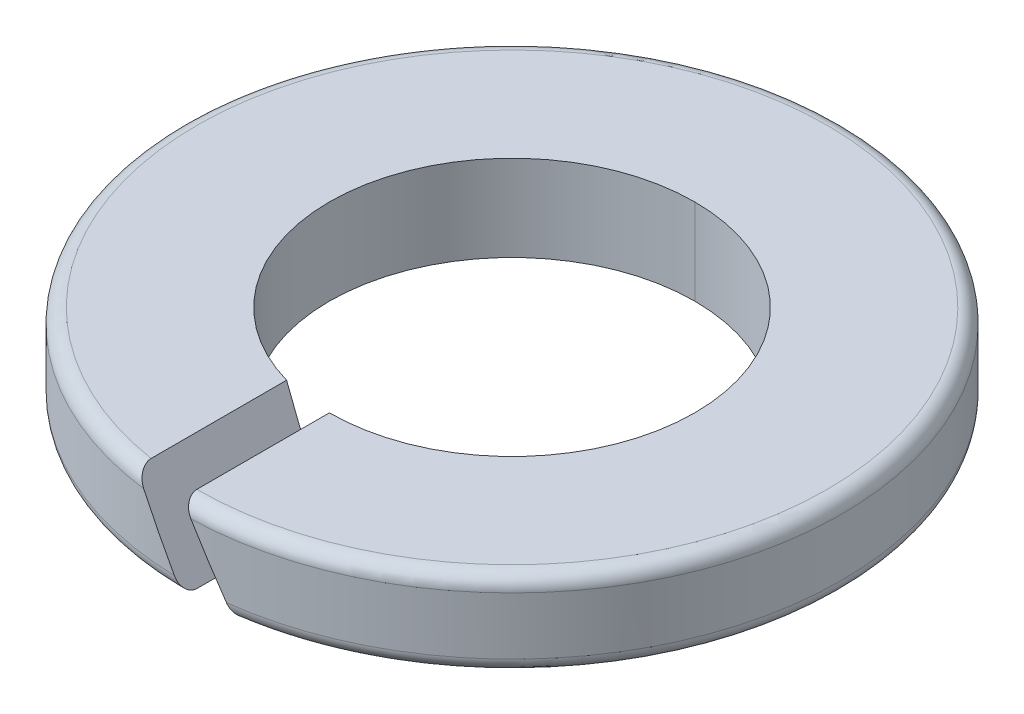
ISO-10303-21;
HEADER;
FILE_DESCRIPTION(('STEP AP214'),'2;1');
FILE_NAME('part.step','',(''),(''),'','','');
FILE_SCHEMA(('AUTOMOTIVE_DESIGN { 1 0 10303 214 1 1 1 1 }'));
ENDSEC;
DATA;
#1=APPLICATION_CONTEXT('core data for automotive mechanical design processes');
#2=APPLICATION_PROTOCOL_DEFINITION('international standard','automotive_design',2000,#1);
#3=PRODUCT_CONTEXT('',#1,'mechanical');
#4=PRODUCT('Part','Part','',(#3));
#5=PRODUCT_RELATED_PRODUCT_CATEGORY('part','',(#4));
#6=PRODUCT_DEFINITION_FORMATION('','',#4);
#7=PRODUCT_DEFINITION_CONTEXT('part definition',#1,'design');
#8=PRODUCT_DEFINITION('design','',#6,#7);
#9=PRODUCT_DEFINITION_SHAPE('','',#8);
#10=(LENGTH_UNIT() NAMED_UNIT(*) SI_UNIT(.MILLI.,.METRE.));
#11=(NAMED_UNIT(*) PLANE_ANGLE_UNIT() SI_UNIT($,.RADIAN.));
#12=(NAMED_UNIT(*) SI_UNIT($,.STERADIAN.) SOLID_ANGLE_UNIT());
#13=UNCERTAINTY_MEASURE_WITH_UNIT(LENGTH_MEASURE(1.E-05),#10,'distance_accuracy_value','');
#14=(GEOMETRIC_REPRESENTATION_CONTEXT(3) GLOBAL_UNCERTAINTY_ASSIGNED_CONTEXT((#13)) GLOBAL_UNIT_ASSIGNED_CONTEXT((#10,
#11,#12)) REPRESENTATION_CONTEXT('',''));
#15=CARTESIAN_POINT('',(0.,0.,0.));
#16=DIRECTION('',(0.,0.,1.));
#17=DIRECTION('',(1.,0.,0.));
#18=AXIS2_PLACEMENT_3D('',#15,#16,#17);
#19=CARTESIAN_POINT('',(0.,1.,0.));
#20=DIRECTION('',(0.,1.,0.));
#21=DIRECTION('',(0.,0.,1.));
#22=AXIS2_PLACEMENT_3D('',#19,#20,#21);
#23=TOROIDAL_SURFACE('',#22,4.4,0.2);
#24=CARTESIAN_POINT('',(0.115510036252427,0.999999999999999,4.5985494921252));
#25=CARTESIAN_POINT('',(0.0704539898807753,1.07801234911434,4.59968124585727));
#26=CARTESIAN_POINT('',(0.0368441418372724,1.13620616349436,4.5463016572108));
#27=CARTESIAN_POINT('',(0.0201525537963844,1.16510683495536,4.51979186453558));
#28=CARTESIAN_POINT('',(0.0101029141817291,1.18250729631908,4.48126663771081));
#29=CARTESIAN_POINT('',(0.,1.20000000000009,4.44253718318641));
#30=CARTESIAN_POINT('',(0.,1.20000000000009,4.4));
#31=B_SPLINE_CURVE_WITH_KNOTS('',2,(#24,#25,#26,#27,#28,#29,#30),.UNSPECIFIED.,.F.,.F.,(3,2,2,
3),(0.,0.5,0.75,1.),.UNSPECIFIED.);
#32=CARTESIAN_POINT('',(0.115510036252427,1.,4.5985494921252));
#33=VERTEX_POINT('',#32);
#34=CARTESIAN_POINT('',(0.,1.20000000000009,4.4));
#35=VERTEX_POINT('',#34);
#36=EDGE_CURVE('E40',#33,#35,#31,.T.);
#37=ORIENTED_EDGE('',*,*,#36,.F.);
#38=CARTESIAN_POINT('',(0.,1.,0.));
#39=DIRECTION('',(0.,-1.,0.));
#40=DIRECTION('',(0.,0.,1.));
#41=AXIS2_PLACEMENT_3D('',#38,#39,#40);
#42=CIRCLE('',#41,4.6);
#43=CARTESIAN_POINT('',(0.,1.,-4.6));
#44=VERTEX_POINT('',#43);
#45=EDGE_CURVE('E196',#44,#33,#42,.T.);
#46=ORIENTED_EDGE('',*,*,#45,.F.);
#47=CARTESIAN_POINT('',(0.,1.,0.));
#48=DIRECTION('',(0.,-1.,0.));
#49=DIRECTION('',(0.,0.,1.));
#50=AXIS2_PLACEMENT_3D('',#47,#48,#49);
#51=CIRCLE('',#50,4.6);
#52=CARTESIAN_POINT('',(-0.577550181261933,1.,4.5635989951051));
#53=VERTEX_POINT('',#52);
#54=EDGE_CURVE('E186',#53,#44,#51,.T.);
#55=ORIENTED_EDGE('',*,*,#54,.F.);
#56=CARTESIAN_POINT('',(-0.693060217514307,1.19999999999998,4.345073938945));
#57=CARTESIAN_POINT('',(-0.693060217514307,1.19999999999998,4.38745660790432));
#58=CARTESIAN_POINT('',(-0.68297241344936,1.18253345874999,4.4290545220933));
#59=CARTESIAN_POINT('',(-0.673714018319656,1.1665029986617,4.46723229831233));
#60=CARTESIAN_POINT('',(-0.656691517779272,1.13702936833024,4.49799643797089));
#61=CARTESIAN_POINT('',(-0.640990583358023,1.10984396534596,4.5263721597492));
#62=CARTESIAN_POINT('',(-0.619981592225992,1.0734679207811,4.5439191005003));
#63=CARTESIAN_POINT('',(-0.599788482894929,1.03850453580398,4.56078460778648));
#64=CARTESIAN_POINT('',(-0.577550181261933,1.,4.5635989951051));
#65=B_SPLINE_CURVE_WITH_KNOTS('',2,(#56,#57,#58,#59,#60,#61,#62,#63,#64),.UNSPECIFIED.,.F.,.F.,
(3,2,2,2,3),(0.,0.25,0.5,0.75,1.),.UNSPECIFIED.);
#66=CARTESIAN_POINT('',(-0.693060217514308,1.19999999999998,4.345073938945));
#67=VERTEX_POINT('',#66);
#68=EDGE_CURVE('E11',#67,#53,#65,.T.);
#69=ORIENTED_EDGE('',*,*,#68,.F.);
#70=CARTESIAN_POINT('',(0.,1.2,0.));
#71=DIRECTION('',(0.,1.,0.));
#72=DIRECTION('',(0.,0.,1.));
#73=AXIS2_PLACEMENT_3D('',#70,#71,#72);
#74=CIRCLE('',#73,4.4);
#75=EDGE_CURVE('E545',#35,#67,#74,.T.);
#76=ORIENTED_EDGE('',*,*,#75,.F.);
#77=EDGE_LOOP('',(#37,#46,#55,#69,#76));
#78=FACE_BOUND('',#77,.T.);
#79=ADVANCED_FACE('F17',(#78),#23,.T.);
#80=CARTESIAN_POINT('',(0.,0.2,0.));
#81=DIRECTION('',(0.,1.,0.));
#82=DIRECTION('',(0.,0.,1.));
#83=AXIS2_PLACEMENT_3D('',#80,#81,#82);
#84=TOROIDAL_SURFACE('',#83,4.4,0.2);
#85=CARTESIAN_POINT('',(0.,0.2,-4.4));
#86=DIRECTION('',(1.,0.,0.));
#87=DIRECTION('',(0.,0.,-1.));
#88=AXIS2_PLACEMENT_3D('',#85,#86,#87);
#89=CIRCLE('',#88,0.2);
#90=CARTESIAN_POINT('',(0.,0.,-4.4));
#91=VERTEX_POINT('',#90);
#92=CARTESIAN_POINT('',(0.,0.2,-4.6));
#93=VERTEX_POINT('',#92);
#94=EDGE_CURVE('E126',#91,#93,#89,.T.);
#95=ORIENTED_EDGE('',*,*,#94,.F.);
#96=CARTESIAN_POINT('',(0.,0.,0.));
#97=DIRECTION('',(0.,-1.,0.));
#98=DIRECTION('',(0.,0.,1.));
#99=AXIS2_PLACEMENT_3D('',#96,#97,#98);
#100=CIRCLE('',#99,4.4);
#101=CARTESIAN_POINT('',(0.,0.,4.4));
#102=VERTEX_POINT('',#101);
#103=EDGE_CURVE('E114',#102,#91,#100,.T.);
#104=ORIENTED_EDGE('',*,*,#103,.F.);
#105=CARTESIAN_POINT('',(-0.115510036252388,0.200000000000003,4.5985494921252));
#106=CARTESIAN_POINT('',(-0.070453989880733,0.121987650885665,4.59968124585727));
#107=CARTESIAN_POINT('',(-0.0368441418372251,0.0637938365056375,4.5463016572108));
#108=CARTESIAN_POINT('',(-0.0201525537963418,0.0348931650446529,4.5197918645356));
#109=CARTESIAN_POINT('',(-0.0101029141816854,0.0174927036809351,4.48126663771081));
#110=CARTESIAN_POINT('',(0.,0.,4.44253718318657));
#111=CARTESIAN_POINT('',(0.,0.,4.4));
#112=B_SPLINE_CURVE_WITH_KNOTS('',2,(#105,#106,#107,#108,#109,#110,#111),.UNSPECIFIED.,.F.,.F.,
(3,2,2,3),(0.,0.5,0.75,1.),.UNSPECIFIED.);
#113=CARTESIAN_POINT('',(-0.115510036252389,0.200000000000004,4.5985494921252));
#114=VERTEX_POINT('',#113);
#115=EDGE_CURVE('E27',#114,#102,#112,.T.);
#116=ORIENTED_EDGE('',*,*,#115,.F.);
#117=CARTESIAN_POINT('',(0.,0.2,0.));
#118=DIRECTION('',(0.,1.,0.));
#119=DIRECTION('',(0.,0.,1.));
#120=AXIS2_PLACEMENT_3D('',#117,#118,#119);
#121=CIRCLE('',#120,4.6);
#122=EDGE_CURVE('E129',#93,#114,#121,.T.);
#123=ORIENTED_EDGE('',*,*,#122,.F.);
#124=EDGE_LOOP('',(#95,#104,#116,#123));
#125=FACE_BOUND('',#124,.T.);
#126=ADVANCED_FACE('F127',(#125),#84,.T.);
#127=CARTESIAN_POINT('',(0.,0.,4.6));
#128=DIRECTION('',(0.865950433514549,0.500129829840177,0.));
#129=DIRECTION('',(0.,0.,-1.));
#130=AXIS2_PLACEMENT_3D('',#127,#128,#129);
#131=PLANE('',#130);
#132=CARTESIAN_POINT('',(-0.577550181261933,1.,4.5635989951051));
#133=CARTESIAN_POINT('',(-0.424189269489599,0.734463053171858,4.58300771670567));
#134=CARTESIAN_POINT('',(-0.270045468418747,0.467570571666525,4.59466774780509));
#135=CARTESIAN_POINT('',(-0.115510036252389,0.200000000000004,4.5985494921252));
#136=(BOUNDED_CURVE() B_SPLINE_CURVE(3,(#132,#133,#134,#135),.UNSPECIFIED.,.F.,
.F.) B_SPLINE_CURVE_WITH_KNOTS((4,4),(4.58650235971111,4.68727546321966),
.UNSPECIFIED.) CURVE() GEOMETRIC_REPRESENTATION_ITEM() RATIONAL_B_SPLINE_CURVE((1.,
0.999153910828086,0.999153910828086,1.)) REPRESENTATION_ITEM(''));
#137=EDGE_CURVE('E554',#53,#114,#136,.T.);
#138=ORIENTED_EDGE('',*,*,#137,.T.);
#139=ORIENTED_EDGE('',*,*,#115,.T.);
#140=DIRECTION('',(0.,0.,-1.));
#141=VECTOR('',#140,1.);
#142=CARTESIAN_POINT('',(0.,0.,4.6));
#143=LINE('',#142,#141);
#144=CARTESIAN_POINT('',(0.,0.,2.55));
#145=VERTEX_POINT('',#144);
#146=EDGE_CURVE('E120',#102,#145,#143,.T.);
#147=ORIENTED_EDGE('',*,*,#146,.T.);
#148=CARTESIAN_POINT('',(-0.693060217514308,1.19999999999998,2.45401050016071));
#149=CARTESIAN_POINT('',(-0.467190385676615,0.808917390789864,2.51780052663904));
#150=CARTESIAN_POINT('',(-0.234704811225704,0.406379945570929,2.55));
#151=CARTESIAN_POINT('',(0.,0.,2.55));
#152=(BOUNDED_CURVE() B_SPLINE_CURVE(3,(#148,#149,#150,#151),.UNSPECIFIED.,.F.,
.F.) B_SPLINE_CURVE_WITH_KNOTS((4,4),(4.43713816382022,4.71238898038469),
.UNSPECIFIED.) CURVE() GEOMETRIC_REPRESENTATION_ITEM() RATIONAL_B_SPLINE_CURVE((1.,
0.993696374712266,0.993696374712266,1.)) REPRESENTATION_ITEM(''));
#153=CARTESIAN_POINT('',(-0.693060217514308,1.19999999999998,2.45401050016071));
#154=VERTEX_POINT('',#153);
#155=EDGE_CURVE('E54',#154,#145,#152,.T.);
#156=ORIENTED_EDGE('',*,*,#155,.F.);
#157=DIRECTION('',(0.,0.,-1.));
#158=VECTOR('',#157,1.);
#159=CARTESIAN_POINT('',(-0.693060217514308,1.19999999999998,4.6));
#160=LINE('',#159,#158);
#161=EDGE_CURVE('E200',#67,#154,#160,.T.);
#162=ORIENTED_EDGE('',*,*,#161,.F.);
#163=ORIENTED_EDGE('',*,*,#68,.T.);
#164=EDGE_LOOP('',(#138,#139,#147,#156,#162,#163));
#165=FACE_BOUND('',#164,.T.);
#166=ADVANCED_FACE('F219',(#165),#131,.T.);
#167=CARTESIAN_POINT('',(0.,1.20000000000009,4.6));
#168=DIRECTION('',(-0.865950433514572,-0.500129829840138,0.));
#169=DIRECTION('',(-0.500129829840138,0.865950433514572,0.));
#170=AXIS2_PLACEMENT_3D('',#167,#168,#169);
#171=PLANE('',#170);
#172=DIRECTION('',(0.,0.,-1.));
#173=VECTOR('',#172,1.);
#174=CARTESIAN_POINT('',(0.693060217514363,-1.11022302462516E-13,4.6));
#175=LINE('',#174,#173);
#176=CARTESIAN_POINT('',(0.693060217514363,-1.11022302462516E-13,4.34507393894499));
#177=VERTEX_POINT('',#176);
#178=CARTESIAN_POINT('',(0.693060217514363,-1.11022302462516E-13,2.45401050016069));
#179=VERTEX_POINT('',#178);
#180=EDGE_CURVE('E123',#177,#179,#175,.T.);
#181=ORIENTED_EDGE('',*,*,#180,.F.);
#182=CARTESIAN_POINT('',(0.693060217514363,-1.11889664200504E-13,4.34507393894499));
#183=CARTESIAN_POINT('',(0.693060217514363,-1.11889664200504E-13,4.38745660790414));
#184=CARTESIAN_POINT('',(0.682972413449357,0.0174665412499759,4.4290545220933));
#185=CARTESIAN_POINT('',(0.67371401831963,0.0334970013383075,4.46723229831238));
#186=CARTESIAN_POINT('',(0.656691517779256,0.0629706316697572,4.49799643797089));
#187=CARTESIAN_POINT('',(0.640990583358031,0.0901560346539976,4.52637215974914));
#188=CARTESIAN_POINT('',(0.61998159222598,0.126532079218902,4.5439191005003));
#189=CARTESIAN_POINT('',(0.599788482894983,0.161495464195906,4.56078460778648));
#190=CARTESIAN_POINT('',(0.577550181261924,0.2,4.5635989951051));
#191=B_SPLINE_CURVE_WITH_KNOTS('',2,(#182,#183,#184,#185,#186,#187,#188,#189,#190),
.UNSPECIFIED.,.F.,.F.,(3,2,2,2,3),(0.,0.25,0.5,0.75,1.),.UNSPECIFIED.);
#192=CARTESIAN_POINT('',(0.577550181261924,0.2,4.56359899510511));
#193=VERTEX_POINT('',#192);
#194=EDGE_CURVE('E139',#177,#193,#191,.T.);
#195=ORIENTED_EDGE('',*,*,#194,.T.);
#196=CARTESIAN_POINT('',(0.577550181261924,0.2,4.56359899510511));
#197=CARTESIAN_POINT('',(0.424189269489606,0.465536946828144,4.58300771670567));
#198=CARTESIAN_POINT('',(0.27004546841877,0.732429428333477,4.59466774780509));
#199=CARTESIAN_POINT('',(0.115510036252427,1.,4.5985494921252));
#200=(BOUNDED_CURVE() B_SPLINE_CURVE(3,(#196,#197,#198,#199),.UNSPECIFIED.,.F.,
.F.) B_SPLINE_CURVE_WITH_KNOTS((4,4),(1.44490970612131,1.54568280962986),
.UNSPECIFIED.) CURVE() GEOMETRIC_REPRESENTATION_ITEM() RATIONAL_B_SPLINE_CURVE((1.,
0.999153910828086,0.999153910828086,1.)) REPRESENTATION_ITEM(''));
#201=EDGE_CURVE('E205',#193,#33,#200,.T.);
#202=ORIENTED_EDGE('',*,*,#201,.T.);
#203=ORIENTED_EDGE('',*,*,#36,.T.);
#204=DIRECTION('',(0.,0.,-1.));
#205=VECTOR('',#204,1.);
#206=CARTESIAN_POINT('',(0.,1.20000000000009,4.6));
#207=LINE('',#206,#205);
#208=CARTESIAN_POINT('',(0.,1.2,2.55));
#209=VERTEX_POINT('',#208);
#210=EDGE_CURVE('E581',#35,#209,#207,.T.);
#211=ORIENTED_EDGE('',*,*,#210,.T.);
#212=CARTESIAN_POINT('',(0.693060217514363,-1.11022302462516E-13,2.45401050016069));
#213=CARTESIAN_POINT('',(0.467190385676666,0.391082609210054,2.51780052663903));
#214=CARTESIAN_POINT('',(0.234704811225749,0.793620054429041,2.55));
#215=CARTESIAN_POINT('',(0.,1.2,2.55));
#216=(BOUNDED_CURVE() B_SPLINE_CURVE(3,(#212,#213,#214,#215),.UNSPECIFIED.,.F.,
.F.) B_SPLINE_CURVE_WITH_KNOTS((4,4),(1.2955455102304,1.57079632679488),
.UNSPECIFIED.) CURVE() GEOMETRIC_REPRESENTATION_ITEM() RATIONAL_B_SPLINE_CURVE((1.,
0.993696374712266,0.993696374712266,1.)) REPRESENTATION_ITEM(''));
#217=EDGE_CURVE('E181',#179,#209,#216,.T.);
#218=ORIENTED_EDGE('',*,*,#217,.F.);
#219=EDGE_LOOP('',(#181,#195,#202,#203,#211,#218));
#220=FACE_BOUND('',#219,.T.);
#221=ADVANCED_FACE('F228',(#220),#171,.T.);
#222=CARTESIAN_POINT('',(0.,1.2,0.));
#223=DIRECTION('',(0.,-1.,0.));
#224=DIRECTION('',(0.,0.,-1.));
#225=AXIS2_PLACEMENT_3D('',#222,#223,#224);
#226=CYLINDRICAL_SURFACE('',#225,2.55);
#227=DIRECTION('',(0.,-1.,0.));
#228=VECTOR('',#227,1.);
#229=CARTESIAN_POINT('',(0.,1.2,-2.55));
#230=LINE('',#229,#228);
#231=CARTESIAN_POINT('',(0.,1.2,-2.55));
#232=VERTEX_POINT('',#231);
#233=CARTESIAN_POINT('',(0.,0.,-2.55));
#234=VERTEX_POINT('',#233);
#235=EDGE_CURVE('E166',#232,#234,#230,.T.);
#236=ORIENTED_EDGE('',*,*,#235,.F.);
#237=CARTESIAN_POINT('',(0.,1.2,0.));
#238=DIRECTION('',(0.,1.,0.));
#239=DIRECTION('',(0.,0.,1.));
#240=AXIS2_PLACEMENT_3D('',#237,#238,#239);
#241=CIRCLE('',#240,2.55);
#242=EDGE_CURVE('E197',#232,#154,#241,.T.);
#243=ORIENTED_EDGE('',*,*,#242,.T.);
#244=ORIENTED_EDGE('',*,*,#155,.T.);
#245=CARTESIAN_POINT('',(0.,0.,0.));
#246=DIRECTION('',(0.,1.,0.));
#247=DIRECTION('',(0.,0.,1.));
#248=AXIS2_PLACEMENT_3D('',#245,#246,#247);
#249=CIRCLE('',#248,2.55);
#250=EDGE_CURVE('E193',#234,#145,#249,.T.);
#251=ORIENTED_EDGE('',*,*,#250,.F.);
#252=EDGE_LOOP('',(#236,#243,#244,#251));
#253=FACE_BOUND('',#252,.T.);
#254=ADVANCED_FACE('F259',(#253),#226,.F.);
#255=CARTESIAN_POINT('',(0.,1.2,0.));
#256=DIRECTION('',(0.,-1.,0.));
#257=DIRECTION('',(0.,0.,-1.));
#258=AXIS2_PLACEMENT_3D('',#255,#256,#257);
#259=CYLINDRICAL_SURFACE('',#258,4.6);
#260=DIRECTION('',(0.,-1.,0.));
#261=VECTOR('',#260,1.);
#262=CARTESIAN_POINT('',(0.,1.2,-4.6));
#263=LINE('',#262,#261);
#264=EDGE_CURVE('E187',#44,#93,#263,.T.);
#265=ORIENTED_EDGE('',*,*,#264,.F.);
#266=ORIENTED_EDGE('',*,*,#45,.T.);
#267=ORIENTED_EDGE('',*,*,#201,.F.);
#268=CARTESIAN_POINT('',(0.,0.2,0.));
#269=DIRECTION('',(0.,1.,0.));
#270=DIRECTION('',(0.,0.,1.));
#271=AXIS2_PLACEMENT_3D('',#268,#269,#270);
#272=CIRCLE('',#271,4.6);
#273=EDGE_CURVE('E134',#193,#93,#272,.T.);
#274=ORIENTED_EDGE('',*,*,#273,.T.);
#275=EDGE_LOOP('',(#265,#266,#267,#274));
#276=FACE_BOUND('',#275,.T.);
#277=ADVANCED_FACE('F229',(#276),#259,.T.);
#278=CARTESIAN_POINT('',(0.,0.,0.));
#279=DIRECTION('',(0.,1.,0.));
#280=DIRECTION('',(1.,0.,0.));
#281=AXIS2_PLACEMENT_3D('',#278,#279,#280);
#282=PLANE('',#281);
#283=ORIENTED_EDGE('',*,*,#146,.F.);
#284=ORIENTED_EDGE('',*,*,#103,.T.);
#285=CARTESIAN_POINT('',(0.,0.,0.));
#286=DIRECTION('',(0.,-1.,0.));
#287=DIRECTION('',(0.,0.,1.));
#288=AXIS2_PLACEMENT_3D('',#285,#286,#287);
#289=CIRCLE('',#288,4.4);
#290=EDGE_CURVE('E118',#91,#177,#289,.T.);
#291=ORIENTED_EDGE('',*,*,#290,.T.);
#292=ORIENTED_EDGE('',*,*,#180,.T.);
#293=CARTESIAN_POINT('',(0.,0.,0.));
#294=DIRECTION('',(0.,1.,0.));
#295=DIRECTION('',(0.,0.,1.));
#296=AXIS2_PLACEMENT_3D('',#293,#294,#295);
#297=CIRCLE('',#296,2.55);
#298=EDGE_CURVE('E176',#179,#234,#297,.T.);
#299=ORIENTED_EDGE('',*,*,#298,.T.);
#300=ORIENTED_EDGE('',*,*,#250,.T.);
#301=EDGE_LOOP('',(#283,#284,#291,#292,#299,#300));
#302=FACE_BOUND('',#301,.T.);
#303=ADVANCED_FACE('F116',(#302),#282,.F.);
#304=CARTESIAN_POINT('',(0.,1.2,0.));
#305=DIRECTION('',(0.,1.,0.));
#306=DIRECTION('',(1.,0.,0.));
#307=AXIS2_PLACEMENT_3D('',#304,#305,#306);
#308=PLANE('',#307);
#309=ORIENTED_EDGE('',*,*,#210,.F.);
#310=ORIENTED_EDGE('',*,*,#75,.T.);
#311=ORIENTED_EDGE('',*,*,#161,.T.);
#312=ORIENTED_EDGE('',*,*,#242,.F.);
#313=CARTESIAN_POINT('',(0.,1.2,0.));
#314=DIRECTION('',(0.,1.,0.));
#315=DIRECTION('',(0.,0.,1.));
#316=AXIS2_PLACEMENT_3D('',#313,#314,#315);
#317=CIRCLE('',#316,2.55);
#318=EDGE_CURVE('E158',#209,#232,#317,.T.);
#319=ORIENTED_EDGE('',*,*,#318,.F.);
#320=EDGE_LOOP('',(#309,#310,#311,#312,#319));
#321=FACE_BOUND('',#320,.T.);
#322=ADVANCED_FACE('F290',(#321),#308,.T.);
#323=CARTESIAN_POINT('',(0.,1.2,0.));
#324=DIRECTION('',(0.,-1.,0.));
#325=DIRECTION('',(0.,0.,-1.));
#326=AXIS2_PLACEMENT_3D('',#323,#324,#325);
#327=CYLINDRICAL_SURFACE('',#326,4.6);
#328=ORIENTED_EDGE('',*,*,#54,.T.);
#329=ORIENTED_EDGE('',*,*,#264,.T.);
#330=ORIENTED_EDGE('',*,*,#122,.T.);
#331=ORIENTED_EDGE('',*,*,#137,.F.);
#332=EDGE_LOOP('',(#328,#329,#330,#331));
#333=FACE_BOUND('',#332,.T.);
#334=ADVANCED_FACE('F289',(#333),#327,.T.);
#335=CARTESIAN_POINT('',(0.,1.2,0.));
#336=DIRECTION('',(0.,-1.,0.));
#337=DIRECTION('',(0.,0.,-1.));
#338=AXIS2_PLACEMENT_3D('',#335,#336,#337);
#339=CYLINDRICAL_SURFACE('',#338,2.55);
#340=ORIENTED_EDGE('',*,*,#318,.T.);
#341=ORIENTED_EDGE('',*,*,#235,.T.);
#342=ORIENTED_EDGE('',*,*,#298,.F.);
#343=ORIENTED_EDGE('',*,*,#217,.T.);
#344=EDGE_LOOP('',(#340,#341,#342,#343));
#345=FACE_BOUND('',#344,.T.);
#346=ADVANCED_FACE('F286',(#345),#339,.F.);
#347=CARTESIAN_POINT('',(0.,0.2,0.));
#348=DIRECTION('',(0.,1.,0.));
#349=DIRECTION('',(0.,0.,1.));
#350=AXIS2_PLACEMENT_3D('',#347,#348,#349);
#351=TOROIDAL_SURFACE('',#350,4.4,0.2);
#352=ORIENTED_EDGE('',*,*,#290,.F.);
#353=ORIENTED_EDGE('',*,*,#94,.T.);
#354=ORIENTED_EDGE('',*,*,#273,.F.);
#355=ORIENTED_EDGE('',*,*,#194,.F.);
#356=EDGE_LOOP('',(#352,#353,#354,#355));
#357=FACE_BOUND('',#356,.T.);
#358=ADVANCED_FACE('F137',(#357),#351,.T.);
#359=CLOSED_SHELL('',(#79,#126,#166,#221,#254,#277,#303,#322,#334,#346,#358));
#360=MANIFOLD_SOLID_BREP('B1',#359);
#361=ADVANCED_BREP_SHAPE_REPRESENTATION('',(#18,#360),#14);
#362=SHAPE_DEFINITION_REPRESENTATION(#9,#361);
ENDSEC;
END-ISO-10303-21;
